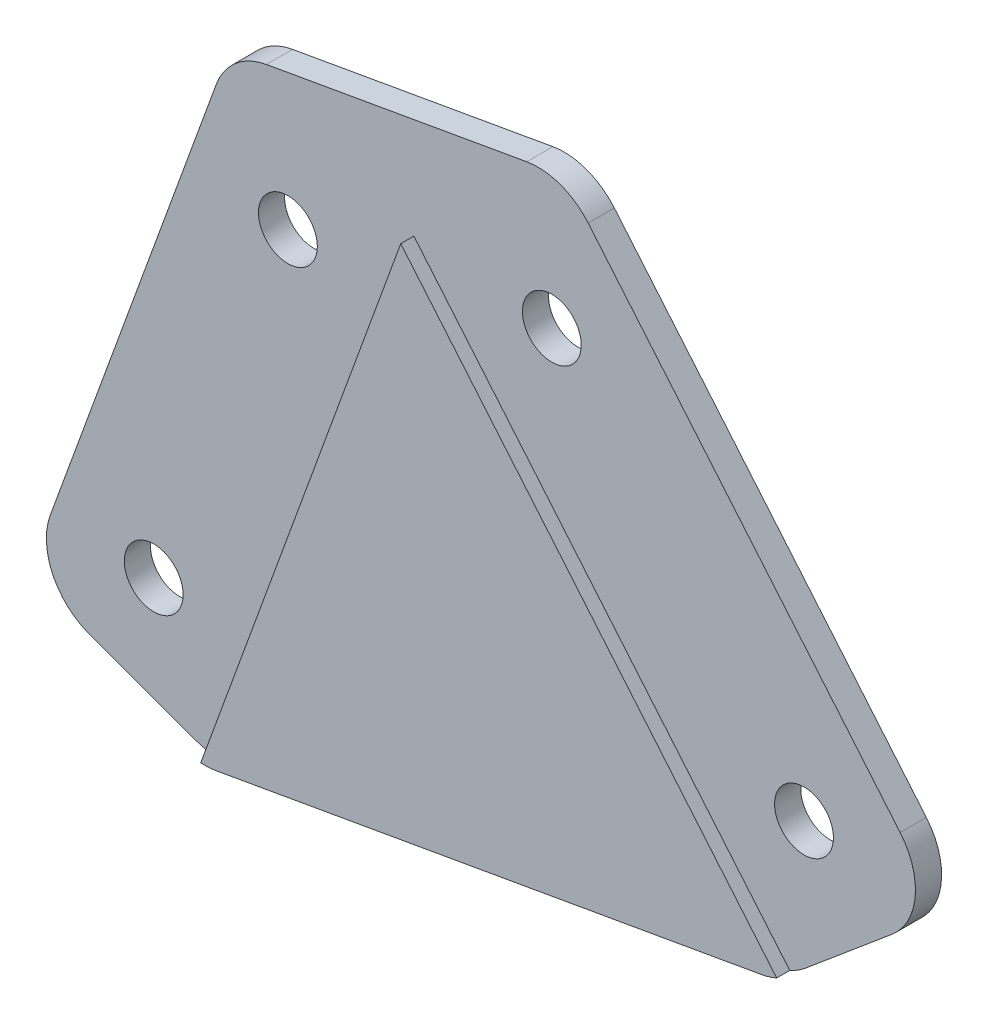
ISO-10303-21;
HEADER;
FILE_DESCRIPTION(('STEP AP214'),'2;1');
FILE_NAME('part.step','',(''),(''),'','','');
FILE_SCHEMA(('AUTOMOTIVE_DESIGN { 1 0 10303 214 1 1 1 1 }'));
ENDSEC;
DATA;
#1=APPLICATION_CONTEXT('core data for automotive mechanical design processes');
#2=APPLICATION_PROTOCOL_DEFINITION('international standard','automotive_design',2000,#1);
#3=PRODUCT_CONTEXT('',#1,'mechanical');
#4=PRODUCT('Part','Part','',(#3));
#5=PRODUCT_RELATED_PRODUCT_CATEGORY('part','',(#4));
#6=PRODUCT_DEFINITION_FORMATION('','',#4);
#7=PRODUCT_DEFINITION_CONTEXT('part definition',#1,'design');
#8=PRODUCT_DEFINITION('design','',#6,#7);
#9=PRODUCT_DEFINITION_SHAPE('','',#8);
#10=(LENGTH_UNIT() NAMED_UNIT(*) SI_UNIT(.MILLI.,.METRE.));
#11=(NAMED_UNIT(*) PLANE_ANGLE_UNIT() SI_UNIT($,.RADIAN.));
#12=(NAMED_UNIT(*) SI_UNIT($,.STERADIAN.) SOLID_ANGLE_UNIT());
#13=UNCERTAINTY_MEASURE_WITH_UNIT(LENGTH_MEASURE(1.E-05),#10,'distance_accuracy_value','');
#14=(GEOMETRIC_REPRESENTATION_CONTEXT(3) GLOBAL_UNCERTAINTY_ASSIGNED_CONTEXT((#13)) GLOBAL_UNIT_ASSIGNED_CONTEXT((#10,
#11,#12)) REPRESENTATION_CONTEXT('',''));
#15=CARTESIAN_POINT('',(0.,0.,0.));
#16=DIRECTION('',(0.,0.,1.));
#17=DIRECTION('',(1.,0.,0.));
#18=AXIS2_PLACEMENT_3D('',#15,#16,#17);
#19=CARTESIAN_POINT('',(269.693265733507,226.299519807985,3.));
#20=DIRECTION('',(-0.766044443118974,-0.642787609686544,0.));
#21=DIRECTION('',(0.642787609686544,-0.766044443118974,0.));
#22=AXIS2_PLACEMENT_3D('',#19,#20,#21);
#23=PLANE('',#22);
#24=DIRECTION('',(0.,0.,-1.));
#25=VECTOR('',#24,1.);
#26=CARTESIAN_POINT('',(146.461449044572,373.161480068931,3.));
#27=LINE('',#26,#25);
#28=CARTESIAN_POINT('',(146.461449044572,373.161480068931,0.));
#29=VERTEX_POINT('',#28);
#30=CARTESIAN_POINT('',(146.461449044572,373.161480068931,2.));
#31=VERTEX_POINT('',#30);
#32=EDGE_CURVE('E255',#29,#31,#27,.F.);
#33=ORIENTED_EDGE('',*,*,#32,.T.);
#34=DIRECTION('',(-0.642787609686544,0.766044443118974,0.));
#35=VECTOR('',#34,1.);
#36=CARTESIAN_POINT('',(140.106367779345,380.735170997994,2.));
#37=LINE('',#36,#35);
#38=CARTESIAN_POINT('',(170.317385434613,344.731082171402,2.));
#39=VERTEX_POINT('',#38);
#40=EDGE_CURVE('E168',#39,#31,#37,.T.);
#41=ORIENTED_EDGE('',*,*,#40,.F.);
#42=DIRECTION('',(0.,0.,-1.));
#43=VECTOR('',#42,1.);
#44=CARTESIAN_POINT('',(170.317385434613,344.731082171402,3.));
#45=LINE('',#44,#43);
#46=CARTESIAN_POINT('',(170.317385434613,344.731082171402,0.));
#47=VERTEX_POINT('',#46);
#48=EDGE_CURVE('E253',#39,#47,#45,.T.);
#49=ORIENTED_EDGE('',*,*,#48,.T.);
#50=DIRECTION('',(-0.642787609686544,0.766044443118974,0.));
#51=VECTOR('',#50,1.);
#52=CARTESIAN_POINT('',(269.693265733507,226.299519807985,0.));
#53=LINE('',#52,#51);
#54=EDGE_CURVE('E209',#47,#29,#53,.T.);
#55=ORIENTED_EDGE('',*,*,#54,.T.);
#56=EDGE_LOOP('',(#33,#41,#49,#55));
#57=FACE_BOUND('',#56,.T.);
#58=ADVANCED_FACE('F41',(#57),#23,.F.);
#59=CARTESIAN_POINT('',(-59.8321388186766,339.324921111203,3.));
#60=DIRECTION('',(0.173648177666931,-0.984807753012208,0.));
#61=DIRECTION('',(0.984807753012208,0.173648177666931,0.));
#62=AXIS2_PLACEMENT_3D('',#59,#60,#61);
#63=PLANE('',#62);
#64=DIRECTION('',(0.,0.,-1.));
#65=VECTOR('',#64,1.);
#66=CARTESIAN_POINT('',(121.862720195086,371.36262701135,3.));
#67=LINE('',#66,#65);
#68=CARTESIAN_POINT('',(121.862720195086,371.36262701135,0.));
#69=VERTEX_POINT('',#68);
#70=CARTESIAN_POINT('',(121.862720195086,371.36262701135,2.));
#71=VERTEX_POINT('',#70);
#72=EDGE_CURVE('E220',#69,#71,#67,.F.);
#73=ORIENTED_EDGE('',*,*,#72,.T.);
#74=DIRECTION('',(0.984807753012208,0.173648177666931,0.));
#75=VECTOR('',#74,1.);
#76=CARTESIAN_POINT('',(-59.8321388186766,339.324921111203,2.));
#77=LINE('',#76,#75);
#78=CARTESIAN_POINT('',(141.762985940643,374.87158078556,2.));
#79=VERTEX_POINT('',#78);
#80=EDGE_CURVE('E188',#71,#79,#77,.T.);
#81=ORIENTED_EDGE('',*,*,#80,.T.);
#82=DIRECTION('',(0.,0.,-1.));
#83=VECTOR('',#82,1.);
#84=CARTESIAN_POINT('',(141.762985940643,374.87158078556,3.));
#85=LINE('',#84,#83);
#86=CARTESIAN_POINT('',(141.762985940643,374.87158078556,0.));
#87=VERTEX_POINT('',#86);
#88=EDGE_CURVE('E239',#79,#87,#85,.T.);
#89=ORIENTED_EDGE('',*,*,#88,.T.);
#90=DIRECTION('',(-0.984807753012208,-0.173648177666931,0.));
#91=VECTOR('',#90,1.);
#92=CARTESIAN_POINT('',(-59.8321388186766,339.324921111203,0.));
#93=LINE('',#92,#91);
#94=EDGE_CURVE('E224',#87,#69,#93,.T.);
#95=ORIENTED_EDGE('',*,*,#94,.T.);
#96=EDGE_LOOP('',(#73,#81,#89,#95));
#97=FACE_BOUND('',#96,.T.);
#98=ADVANCED_FACE('F322',(#97),#63,.F.);
#99=CARTESIAN_POINT('',(-14.0953893117889,5.1303021498852,3.));
#100=DIRECTION('',(0.939692620785907,-0.342020143325673,0.));
#101=DIRECTION('',(0.342020143325673,0.939692620785907,0.));
#102=AXIS2_PLACEMENT_3D('',#99,#100,#101);
#103=PLANE('',#102);
#104=DIRECTION('',(0.,0.,-1.));
#105=VECTOR('',#104,1.);
#106=CARTESIAN_POINT('',(105.339019355551,333.273643069312,3.));
#107=LINE('',#106,#105);
#108=CARTESIAN_POINT('',(105.339019355551,333.273643069312,0.));
#109=VERTEX_POINT('',#108);
#110=CARTESIAN_POINT('',(105.339019355551,333.273643069312,2.));
#111=VERTEX_POINT('',#110);
#112=EDGE_CURVE('E263',#109,#111,#107,.F.);
#113=ORIENTED_EDGE('',*,*,#112,.T.);
#114=DIRECTION('',(-0.342020143325673,-0.939692620785907,0.));
#115=VECTOR('',#114,1.);
#116=CARTESIAN_POINT('',(121.413966091857,377.439196246249,2.));
#117=LINE('',#116,#115);
#118=CARTESIAN_POINT('',(118.032497979491,368.148688962917,2.));
#119=VERTEX_POINT('',#118);
#120=EDGE_CURVE('E56',#119,#111,#117,.T.);
#121=ORIENTED_EDGE('',*,*,#120,.F.);
#122=DIRECTION('',(0.,0.,-1.));
#123=VECTOR('',#122,1.);
#124=CARTESIAN_POINT('',(118.032497979491,368.148688962917,3.));
#125=LINE('',#124,#123);
#126=CARTESIAN_POINT('',(118.032497979491,368.148688962917,0.));
#127=VERTEX_POINT('',#126);
#128=EDGE_CURVE('E266',#119,#127,#125,.T.);
#129=ORIENTED_EDGE('',*,*,#128,.T.);
#130=DIRECTION('',(-0.342020143325673,-0.939692620785907,0.));
#131=VECTOR('',#130,1.);
#132=CARTESIAN_POINT('',(-14.0953893117889,5.1303021498852,0.));
#133=LINE('',#132,#131);
#134=EDGE_CURVE('E227',#127,#109,#133,.T.);
#135=ORIENTED_EDGE('',*,*,#134,.T.);
#136=EDGE_LOOP('',(#113,#121,#129,#135));
#137=FACE_BOUND('',#136,.T.);
#138=ADVANCED_FACE('F330',(#137),#103,.F.);
#139=CARTESIAN_POINT('',(117.724307950711,323.444877815497,3.));
#140=DIRECTION('',(0.342020143325671,0.939692620785907,0.));
#141=DIRECTION('',(-0.939692620785908,0.342020143325671,0.));
#142=AXIS2_PLACEMENT_3D('',#139,#140,#141);
#143=PLANE('',#142);
#144=DIRECTION('',(0.,0.,-1.));
#145=VECTOR('',#144,1.);
#146=CARTESIAN_POINT('',(116.465358556346,323.903097921494,3.));
#147=LINE('',#146,#145);
#148=CARTESIAN_POINT('',(116.465358556346,323.903097921494,0.));
#149=VERTEX_POINT('',#148);
#150=CARTESIAN_POINT('',(116.465358556346,323.903097921494,2.));
#151=VERTEX_POINT('',#150);
#152=EDGE_CURVE('E279',#149,#151,#147,.F.);
#153=ORIENTED_EDGE('',*,*,#152,.T.);
#154=DIRECTION('',(0.939692620785907,-0.342020143325672,0.));
#155=VECTOR('',#154,1.);
#156=CARTESIAN_POINT('',(103.628918638922,328.575179965382,2.));
#157=LINE('',#156,#155);
#158=CARTESIAN_POINT('',(108.327381742852,326.865079248754,2.));
#159=VERTEX_POINT('',#158);
#160=EDGE_CURVE('E159',#159,#151,#157,.T.);
#161=ORIENTED_EDGE('',*,*,#160,.F.);
#162=DIRECTION('',(0.,0.,-1.));
#163=VECTOR('',#162,1.);
#164=CARTESIAN_POINT('',(108.327381742852,326.865079248754,3.));
#165=LINE('',#164,#163);
#166=CARTESIAN_POINT('',(108.327381742852,326.865079248754,0.));
#167=VERTEX_POINT('',#166);
#168=EDGE_CURVE('E277',#159,#167,#165,.T.);
#169=ORIENTED_EDGE('',*,*,#168,.T.);
#170=DIRECTION('',(0.939692620785907,-0.342020143325671,0.));
#171=VECTOR('',#170,1.);
#172=CARTESIAN_POINT('',(117.724307950711,323.444877815497,0.));
#173=LINE('',#172,#171);
#174=EDGE_CURVE('E230',#167,#149,#173,.T.);
#175=ORIENTED_EDGE('',*,*,#174,.T.);
#176=EDGE_LOOP('',(#153,#161,#169,#175));
#177=FACE_BOUND('',#176,.T.);
#178=ADVANCED_FACE('F336',(#177),#143,.F.);
#179=CARTESIAN_POINT('',(-51.7625094930553,293.559779025751,3.));
#180=DIRECTION('',(-0.173648177666932,0.984807753012208,0.));
#181=DIRECTION('',(-0.984807753012208,-0.173648177666932,0.));
#182=AXIS2_PLACEMENT_3D('',#179,#180,#181);
#183=PLANE('',#182);
#184=DIRECTION('',(0.984807753012208,0.173648177666932,0.));
#185=VECTOR('',#184,1.);
#186=CARTESIAN_POINT('',(-51.7625094930553,293.559779025751,0.));
#187=LINE('',#186,#185);
#188=CARTESIAN_POINT('',(119.043700161309,323.677522260362,0.));
#189=VERTEX_POINT('',#188);
#190=CARTESIAN_POINT('',(160.721264625663,331.026401365644,0.));
#191=VERTEX_POINT('',#190);
#192=EDGE_CURVE('E233',#189,#191,#187,.T.);
#193=ORIENTED_EDGE('',*,*,#192,.T.);
#194=DIRECTION('',(0.,0.,-1.));
#195=VECTOR('',#194,1.);
#196=CARTESIAN_POINT('',(160.721264625663,331.026401365644,3.));
#197=LINE('',#196,#195);
#198=CARTESIAN_POINT('',(160.721264625663,331.026401365644,3.));
#199=VERTEX_POINT('',#198);
#200=EDGE_CURVE('E64',#191,#199,#197,.F.);
#201=ORIENTED_EDGE('',*,*,#200,.T.);
#202=DIRECTION('',(0.984807753012208,0.173648177666932,0.));
#203=VECTOR('',#202,1.);
#204=CARTESIAN_POINT('',(-51.7625094930553,293.559779025751,3.));
#205=LINE('',#204,#203);
#206=CARTESIAN_POINT('',(119.043700161309,323.677522260362,3.));
#207=VERTEX_POINT('',#206);
#208=EDGE_CURVE('E218',#207,#199,#205,.T.);
#209=ORIENTED_EDGE('',*,*,#208,.F.);
#210=DIRECTION('',(0.,0.,-1.));
#211=VECTOR('',#210,1.);
#212=CARTESIAN_POINT('',(119.043700161309,323.677522260362,3.));
#213=LINE('',#212,#211);
#214=EDGE_CURVE('E273',#207,#189,#213,.T.);
#215=ORIENTED_EDGE('',*,*,#214,.T.);
#216=EDGE_LOOP('',(#193,#201,#209,#215));
#217=FACE_BOUND('',#216,.T.);
#218=ADVANCED_FACE('F291',(#217),#183,.F.);
#219=CARTESIAN_POINT('',(-96.1619422504616,114.601340147824,3.));
#220=DIRECTION('',(-0.642787609686542,0.766044443118976,0.));
#221=DIRECTION('',(-0.766044443118976,-0.642787609686542,0.));
#222=AXIS2_PLACEMENT_3D('',#219,#220,#221);
#223=PLANE('',#222);
#224=DIRECTION('',(0.,0.,-1.));
#225=VECTOR('',#224,1.);
#226=CARTESIAN_POINT('',(169.701101267451,337.686921907375,3.));
#227=LINE('',#226,#225);
#228=CARTESIAN_POINT('',(169.701101267451,337.686921907375,0.));
#229=VERTEX_POINT('',#228);
#230=CARTESIAN_POINT('',(169.701101267451,337.686921907375,2.));
#231=VERTEX_POINT('',#230);
#232=EDGE_CURVE('E270',#229,#231,#227,.F.);
#233=ORIENTED_EDGE('',*,*,#232,.T.);
#234=DIRECTION('',(0.766044443118974,0.642787609686544,0.));
#235=VECTOR('',#234,1.);
#236=CARTESIAN_POINT('',(173.531323483045,340.900859955807,2.));
#237=LINE('',#236,#235);
#238=CARTESIAN_POINT('',(163.066961785761,332.120217915111,2.));
#239=VERTEX_POINT('',#238);
#240=EDGE_CURVE('E172',#239,#231,#237,.T.);
#241=ORIENTED_EDGE('',*,*,#240,.F.);
#242=DIRECTION('',(0.,0.,-1.));
#243=VECTOR('',#242,1.);
#244=CARTESIAN_POINT('',(163.066961785761,332.120217915111,3.));
#245=LINE('',#244,#243);
#246=CARTESIAN_POINT('',(163.066961785761,332.120217915111,0.));
#247=VERTEX_POINT('',#246);
#248=EDGE_CURVE('E268',#239,#247,#245,.T.);
#249=ORIENTED_EDGE('',*,*,#248,.T.);
#250=DIRECTION('',(0.766044443118976,0.642787609686542,0.));
#251=VECTOR('',#250,1.);
#252=CARTESIAN_POINT('',(-96.1619422504616,114.601340147824,0.));
#253=LINE('',#252,#251);
#254=EDGE_CURVE('E221',#247,#229,#253,.T.);
#255=ORIENTED_EDGE('',*,*,#254,.T.);
#256=EDGE_LOOP('',(#233,#241,#249,#255));
#257=FACE_BOUND('',#256,.T.);
#258=ADVANCED_FACE('F305',(#257),#223,.F.);
#259=CARTESIAN_POINT('',(0.,0.,3.));
#260=DIRECTION('',(0.,0.,1.));
#261=DIRECTION('',(1.,0.,0.));
#262=AXIS2_PLACEMENT_3D('',#259,#260,#261);
#263=PLANE('',#262);
#264=DIRECTION('',(0.642787609686543,-0.766044443118975,0.));
#265=VECTOR('',#264,1.);
#266=CARTESIAN_POINT('',(133.132579218133,365.632564975562,3.));
#267=LINE('',#266,#265);
#268=CARTESIAN_POINT('',(133.132579218133,365.632564975562,3.));
#269=VERTEX_POINT('',#268);
#270=CARTESIAN_POINT('',(161.875711881928,331.377833361072,3.));
#271=VERTEX_POINT('',#270);
#272=EDGE_CURVE('E179',#269,#271,#267,.T.);
#273=ORIENTED_EDGE('',*,*,#272,.F.);
#274=DIRECTION('',(0.342020143325671,0.939692620785907,0.));
#275=VECTOR('',#274,1.);
#276=CARTESIAN_POINT('',(133.132579218133,365.632564975562,3.));
#277=LINE('',#276,#275);
#278=CARTESIAN_POINT('',(117.838677772064,323.612916097124,3.));
#279=VERTEX_POINT('',#278);
#280=EDGE_CURVE('E165',#279,#269,#277,.T.);
#281=ORIENTED_EDGE('',*,*,#280,.F.);
#282=CARTESIAN_POINT('',(118.175459272974,328.601561025423,3.));
#283=DIRECTION('',(0.,0.,1.));
#284=DIRECTION('',(1.,0.,0.));
#285=AXIS2_PLACEMENT_3D('',#282,#283,#284);
#286=CIRCLE('',#285,5.);
#287=EDGE_CURVE('E258',#279,#207,#286,.T.);
#288=ORIENTED_EDGE('',*,*,#287,.T.);
#289=ORIENTED_EDGE('',*,*,#208,.T.);
#290=CARTESIAN_POINT('',(159.853023737329,335.950440130705,3.));
#291=DIRECTION('',(0.,0.,1.));
#292=DIRECTION('',(1.,0.,0.));
#293=AXIS2_PLACEMENT_3D('',#290,#291,#292);
#294=CIRCLE('',#293,5.);
#295=EDGE_CURVE('E260',#199,#271,#294,.T.);
#296=ORIENTED_EDGE('',*,*,#295,.T.);
#297=EDGE_LOOP('',(#273,#281,#288,#289,#296));
#298=FACE_BOUND('',#297,.T.);
#299=ADVANCED_FACE('F286',(#298),#263,.T.);
#300=CARTESIAN_POINT('',(0.,0.,0.));
#301=DIRECTION('',(0.,0.,1.));
#302=DIRECTION('',(1.,0.,0.));
#303=AXIS2_PLACEMENT_3D('',#300,#301,#302);
#304=PLANE('',#303);
#305=CARTESIAN_POINT('',(113.241764369759,333.057723546334,0.));
#306=DIRECTION('',(0.,0.,1.));
#307=DIRECTION('',(1.,0.,0.));
#308=AXIS2_PLACEMENT_3D('',#305,#306,#307);
#309=CIRCLE('',#308,2.25);
#310=CARTESIAN_POINT('',(115.491764369759,333.057723546334,0.));
#311=VERTEX_POINT('',#310);
#312=EDGE_CURVE('E206',#311,#311,#309,.T.);
#313=ORIENTED_EDGE('',*,*,#312,.T.);
#314=EDGE_LOOP('',(#313));
#315=FACE_BOUND('',#314,.T.);
#316=CARTESIAN_POINT('',(123.50236866953,361.248502169911,0.));
#317=DIRECTION('',(0.,0.,1.));
#318=DIRECTION('',(1.,0.,0.));
#319=AXIS2_PLACEMENT_3D('',#316,#317,#318);
#320=CIRCLE('',#319,2.25000000000001);
#321=CARTESIAN_POINT('',(125.75236866953,361.248502169911,0.));
#322=VERTEX_POINT('',#321);
#323=EDGE_CURVE('E210',#322,#322,#320,.T.);
#324=ORIENTED_EDGE('',*,*,#323,.T.);
#325=EDGE_LOOP('',(#324));
#326=FACE_BOUND('',#325,.T.);
#327=CARTESIAN_POINT('',(143.681454796408,364.80661950012,0.));
#328=DIRECTION('',(0.,0.,1.));
#329=DIRECTION('',(1.,0.,0.));
#330=AXIS2_PLACEMENT_3D('',#327,#328,#329);
#331=CIRCLE('',#330,2.25000000000001);
#332=CARTESIAN_POINT('',(145.931454796408,364.80661950012,0.));
#333=VERTEX_POINT('',#332);
#334=EDGE_CURVE('E213',#333,#333,#331,.T.);
#335=ORIENTED_EDGE('',*,*,#334,.T.);
#336=EDGE_LOOP('',(#335));
#337=FACE_BOUND('',#336,.T.);
#338=CARTESIAN_POINT('',(162.965083087004,341.825286206551,0.));
#339=DIRECTION('',(0.,0.,1.));
#340=DIRECTION('',(1.,0.,0.));
#341=AXIS2_PLACEMENT_3D('',#338,#339,#340);
#342=CIRCLE('',#341,2.25000000000001);
#343=CARTESIAN_POINT('',(165.215083087004,341.825286206551,0.));
#344=VERTEX_POINT('',#343);
#345=EDGE_CURVE('E205',#344,#344,#342,.T.);
#346=ORIENTED_EDGE('',*,*,#345,.T.);
#347=EDGE_LOOP('',(#346));
#348=FACE_BOUND('',#347,.T.);
#349=ORIENTED_EDGE('',*,*,#94,.F.);
#350=CARTESIAN_POINT('',(142.631226828978,369.947542020499,0.));
#351=DIRECTION('',(0.,0.,1.));
#352=DIRECTION('',(1.,0.,0.));
#353=AXIS2_PLACEMENT_3D('',#350,#351,#352);
#354=CIRCLE('',#353,5.);
#355=EDGE_CURVE('E251',#87,#29,#354,.F.);
#356=ORIENTED_EDGE('',*,*,#355,.T.);
#357=ORIENTED_EDGE('',*,*,#54,.F.);
#358=CARTESIAN_POINT('',(166.487163219018,341.51714412297,0.));
#359=DIRECTION('',(0.,0.,1.));
#360=DIRECTION('',(1.,0.,0.));
#361=AXIS2_PLACEMENT_3D('',#358,#359,#360);
#362=CIRCLE('',#361,5.);
#363=EDGE_CURVE('E247',#47,#229,#362,.F.);
#364=ORIENTED_EDGE('',*,*,#363,.T.);
#365=ORIENTED_EDGE('',*,*,#254,.F.);
#366=CARTESIAN_POINT('',(159.853023737329,335.950440130705,0.));
#367=DIRECTION('',(0.,0.,1.));
#368=DIRECTION('',(1.,0.,0.));
#369=AXIS2_PLACEMENT_3D('',#366,#367,#368);
#370=CIRCLE('',#369,5.);
#371=EDGE_CURVE('E245',#247,#191,#370,.F.);
#372=ORIENTED_EDGE('',*,*,#371,.T.);
#373=ORIENTED_EDGE('',*,*,#192,.F.);
#374=CARTESIAN_POINT('',(118.175459272974,328.601561025423,0.));
#375=DIRECTION('',(0.,0.,1.));
#376=DIRECTION('',(1.,0.,0.));
#377=AXIS2_PLACEMENT_3D('',#374,#375,#376);
#378=CIRCLE('',#377,5.);
#379=EDGE_CURVE('E243',#189,#149,#378,.F.);
#380=ORIENTED_EDGE('',*,*,#379,.T.);
#381=ORIENTED_EDGE('',*,*,#174,.F.);
#382=CARTESIAN_POINT('',(110.03748245948,331.563542352683,0.));
#383=DIRECTION('',(0.,0.,1.));
#384=DIRECTION('',(1.,0.,0.));
#385=AXIS2_PLACEMENT_3D('',#382,#383,#384);
#386=CIRCLE('',#385,5.);
#387=EDGE_CURVE('E241',#167,#109,#386,.F.);
#388=ORIENTED_EDGE('',*,*,#387,.T.);
#389=ORIENTED_EDGE('',*,*,#134,.F.);
#390=CARTESIAN_POINT('',(122.730961083421,366.438588246289,0.));
#391=DIRECTION('',(0.,0.,1.));
#392=DIRECTION('',(1.,0.,0.));
#393=AXIS2_PLACEMENT_3D('',#390,#391,#392);
#394=CIRCLE('',#393,5.);
#395=EDGE_CURVE('E249',#127,#69,#394,.F.);
#396=ORIENTED_EDGE('',*,*,#395,.T.);
#397=EDGE_LOOP('',(#349,#356,#357,#364,#365,#372,#373,#380,#381,#388,#389,#396));
#398=FACE_BOUND('',#397,.T.);
#399=ADVANCED_FACE('F294',(#315,#326,#337,#348,#398),#304,.F.);
#400=CARTESIAN_POINT('',(162.965083087004,341.825286206551,0.));
#401=DIRECTION('',(0.,0.,1.));
#402=DIRECTION('',(1.,0.,0.));
#403=AXIS2_PLACEMENT_3D('',#400,#401,#402);
#404=CYLINDRICAL_SURFACE('',#403,2.25000000000001);
#405=CARTESIAN_POINT('',(162.965083087004,341.825286206551,2.));
#406=DIRECTION('',(0.,0.,-1.));
#407=DIRECTION('',(-1.,0.,0.));
#408=AXIS2_PLACEMENT_3D('',#405,#406,#407);
#409=CIRCLE('',#408,2.25000000000001);
#410=CARTESIAN_POINT('',(160.715083087004,341.825286206551,2.));
#411=VERTEX_POINT('',#410);
#412=EDGE_CURVE('E202',#411,#411,#409,.F.);
#413=ORIENTED_EDGE('',*,*,#412,.T.);
#414=EDGE_LOOP('',(#413));
#415=FACE_BOUND('',#414,.T.);
#416=ORIENTED_EDGE('',*,*,#345,.F.);
#417=EDGE_LOOP('',(#416));
#418=FACE_BOUND('',#417,.T.);
#419=ADVANCED_FACE('F413',(#415,#418),#404,.F.);
#420=CARTESIAN_POINT('',(143.681454796408,364.80661950012,0.));
#421=DIRECTION('',(0.,0.,1.));
#422=DIRECTION('',(1.,0.,0.));
#423=AXIS2_PLACEMENT_3D('',#420,#421,#422);
#424=CYLINDRICAL_SURFACE('',#423,2.25000000000001);
#425=CARTESIAN_POINT('',(143.681454796408,364.80661950012,2.));
#426=DIRECTION('',(0.,0.,-1.));
#427=DIRECTION('',(-1.,0.,0.));
#428=AXIS2_PLACEMENT_3D('',#425,#426,#427);
#429=CIRCLE('',#428,2.25000000000001);
#430=CARTESIAN_POINT('',(141.431454796408,364.80661950012,2.));
#431=VERTEX_POINT('',#430);
#432=EDGE_CURVE('E199',#431,#431,#429,.F.);
#433=ORIENTED_EDGE('',*,*,#432,.T.);
#434=EDGE_LOOP('',(#433));
#435=FACE_BOUND('',#434,.T.);
#436=ORIENTED_EDGE('',*,*,#334,.F.);
#437=EDGE_LOOP('',(#436));
#438=FACE_BOUND('',#437,.T.);
#439=ADVANCED_FACE('F409',(#435,#438),#424,.F.);
#440=CARTESIAN_POINT('',(123.50236866953,361.248502169911,0.));
#441=DIRECTION('',(0.,0.,1.));
#442=DIRECTION('',(1.,0.,0.));
#443=AXIS2_PLACEMENT_3D('',#440,#441,#442);
#444=CYLINDRICAL_SURFACE('',#443,2.25000000000001);
#445=CARTESIAN_POINT('',(123.50236866953,361.248502169911,2.));
#446=DIRECTION('',(0.,0.,-1.));
#447=DIRECTION('',(-1.,0.,0.));
#448=AXIS2_PLACEMENT_3D('',#445,#446,#447);
#449=CIRCLE('',#448,2.25000000000001);
#450=CARTESIAN_POINT('',(121.25236866953,361.248502169911,2.));
#451=VERTEX_POINT('',#450);
#452=EDGE_CURVE('E196',#451,#451,#449,.F.);
#453=ORIENTED_EDGE('',*,*,#452,.T.);
#454=EDGE_LOOP('',(#453));
#455=FACE_BOUND('',#454,.T.);
#456=ORIENTED_EDGE('',*,*,#323,.F.);
#457=EDGE_LOOP('',(#456));
#458=FACE_BOUND('',#457,.T.);
#459=ADVANCED_FACE('F405',(#455,#458),#444,.F.);
#460=CARTESIAN_POINT('',(113.241764369759,333.057723546334,0.));
#461=DIRECTION('',(0.,0.,1.));
#462=DIRECTION('',(1.,0.,0.));
#463=AXIS2_PLACEMENT_3D('',#460,#461,#462);
#464=CYLINDRICAL_SURFACE('',#463,2.25);
#465=CARTESIAN_POINT('',(113.241764369759,333.057723546334,2.));
#466=DIRECTION('',(0.,0.,-1.));
#467=DIRECTION('',(-1.,0.,0.));
#468=AXIS2_PLACEMENT_3D('',#465,#466,#467);
#469=CIRCLE('',#468,2.25);
#470=CARTESIAN_POINT('',(110.991764369759,333.057723546334,2.));
#471=VERTEX_POINT('',#470);
#472=EDGE_CURVE('E193',#471,#471,#469,.F.);
#473=ORIENTED_EDGE('',*,*,#472,.T.);
#474=EDGE_LOOP('',(#473));
#475=FACE_BOUND('',#474,.T.);
#476=ORIENTED_EDGE('',*,*,#312,.F.);
#477=EDGE_LOOP('',(#476));
#478=FACE_BOUND('',#477,.T.);
#479=ADVANCED_FACE('F357',(#475,#478),#464,.F.);
#480=CARTESIAN_POINT('',(142.631226828978,369.947542020499,3.));
#481=DIRECTION('',(0.,0.,-1.));
#482=DIRECTION('',(-1.,0.,0.));
#483=AXIS2_PLACEMENT_3D('',#480,#481,#482);
#484=CYLINDRICAL_SURFACE('',#483,5.);
#485=CARTESIAN_POINT('',(142.631226828978,369.947542020499,2.));
#486=DIRECTION('',(0.,0.,-1.));
#487=DIRECTION('',(-1.,0.,0.));
#488=AXIS2_PLACEMENT_3D('',#485,#486,#487);
#489=CIRCLE('',#488,5.);
#490=EDGE_CURVE('E191',#31,#79,#489,.F.);
#491=ORIENTED_EDGE('',*,*,#490,.F.);
#492=ORIENTED_EDGE('',*,*,#32,.F.);
#493=ORIENTED_EDGE('',*,*,#355,.F.);
#494=ORIENTED_EDGE('',*,*,#88,.F.);
#495=EDGE_LOOP('',(#491,#492,#493,#494));
#496=FACE_BOUND('',#495,.T.);
#497=ADVANCED_FACE('F318',(#496),#484,.T.);
#498=CARTESIAN_POINT('',(122.730961083421,366.438588246289,3.));
#499=DIRECTION('',(0.,0.,-1.));
#500=DIRECTION('',(-1.,0.,0.));
#501=AXIS2_PLACEMENT_3D('',#498,#499,#500);
#502=CYLINDRICAL_SURFACE('',#501,5.);
#503=CARTESIAN_POINT('',(122.730961083421,366.438588246289,2.));
#504=DIRECTION('',(0.,0.,-1.));
#505=DIRECTION('',(-1.,0.,0.));
#506=AXIS2_PLACEMENT_3D('',#503,#504,#505);
#507=CIRCLE('',#506,5.);
#508=EDGE_CURVE('E186',#71,#119,#507,.F.);
#509=ORIENTED_EDGE('',*,*,#508,.F.);
#510=ORIENTED_EDGE('',*,*,#72,.F.);
#511=ORIENTED_EDGE('',*,*,#395,.F.);
#512=ORIENTED_EDGE('',*,*,#128,.F.);
#513=EDGE_LOOP('',(#509,#510,#511,#512));
#514=FACE_BOUND('',#513,.T.);
#515=ADVANCED_FACE('F326',(#514),#502,.T.);
#516=CARTESIAN_POINT('',(166.487163219018,341.51714412297,3.));
#517=DIRECTION('',(0.,0.,-1.));
#518=DIRECTION('',(-1.,0.,0.));
#519=AXIS2_PLACEMENT_3D('',#516,#517,#518);
#520=CYLINDRICAL_SURFACE('',#519,5.);
#521=CARTESIAN_POINT('',(166.487163219018,341.51714412297,2.));
#522=DIRECTION('',(0.,0.,-1.));
#523=DIRECTION('',(-1.,0.,0.));
#524=AXIS2_PLACEMENT_3D('',#521,#522,#523);
#525=CIRCLE('',#524,5.);
#526=EDGE_CURVE('E184',#231,#39,#525,.F.);
#527=ORIENTED_EDGE('',*,*,#526,.F.);
#528=ORIENTED_EDGE('',*,*,#232,.F.);
#529=ORIENTED_EDGE('',*,*,#363,.F.);
#530=ORIENTED_EDGE('',*,*,#48,.F.);
#531=EDGE_LOOP('',(#527,#528,#529,#530));
#532=FACE_BOUND('',#531,.T.);
#533=ADVANCED_FACE('F309',(#532),#520,.T.);
#534=CARTESIAN_POINT('',(159.853023737329,335.950440130705,3.));
#535=DIRECTION('',(0.,0.,-1.));
#536=DIRECTION('',(-1.,0.,0.));
#537=AXIS2_PLACEMENT_3D('',#534,#535,#536);
#538=CYLINDRICAL_SURFACE('',#537,5.);
#539=DIRECTION('',(0.,0.,-1.));
#540=VECTOR('',#539,1.);
#541=CARTESIAN_POINT('',(161.875711881928,331.377833361072,3.));
#542=LINE('',#541,#540);
#543=CARTESIAN_POINT('',(161.875711881928,331.377833361072,2.));
#544=VERTEX_POINT('',#543);
#545=EDGE_CURVE('E11',#271,#544,#542,.T.);
#546=ORIENTED_EDGE('',*,*,#545,.F.);
#547=ORIENTED_EDGE('',*,*,#295,.F.);
#548=ORIENTED_EDGE('',*,*,#200,.F.);
#549=ORIENTED_EDGE('',*,*,#371,.F.);
#550=ORIENTED_EDGE('',*,*,#248,.F.);
#551=CARTESIAN_POINT('',(159.853023737329,335.950440130705,2.));
#552=DIRECTION('',(0.,0.,-1.));
#553=DIRECTION('',(-1.,0.,0.));
#554=AXIS2_PLACEMENT_3D('',#551,#552,#553);
#555=CIRCLE('',#554,5.);
#556=EDGE_CURVE('E182',#544,#239,#555,.F.);
#557=ORIENTED_EDGE('',*,*,#556,.F.);
#558=EDGE_LOOP('',(#546,#547,#548,#549,#550,#557));
#559=FACE_BOUND('',#558,.T.);
#560=ADVANCED_FACE('F300',(#559),#538,.T.);
#561=CARTESIAN_POINT('',(118.175459272974,328.601561025423,3.));
#562=DIRECTION('',(0.,0.,-1.));
#563=DIRECTION('',(-1.,0.,0.));
#564=AXIS2_PLACEMENT_3D('',#561,#562,#563);
#565=CYLINDRICAL_SURFACE('',#564,5.);
#566=DIRECTION('',(0.,0.,-1.));
#567=VECTOR('',#566,1.);
#568=CARTESIAN_POINT('',(117.838677772064,323.612916097124,3.));
#569=LINE('',#568,#567);
#570=CARTESIAN_POINT('',(117.838677772064,323.612916097124,2.));
#571=VERTEX_POINT('',#570);
#572=EDGE_CURVE('E49',#571,#279,#569,.F.);
#573=ORIENTED_EDGE('',*,*,#572,.F.);
#574=CARTESIAN_POINT('',(118.175459272974,328.601561025423,2.));
#575=DIRECTION('',(0.,0.,-1.));
#576=DIRECTION('',(-1.,0.,0.));
#577=AXIS2_PLACEMENT_3D('',#574,#575,#576);
#578=CIRCLE('',#577,5.);
#579=EDGE_CURVE('E156',#151,#571,#578,.F.);
#580=ORIENTED_EDGE('',*,*,#579,.F.);
#581=ORIENTED_EDGE('',*,*,#152,.F.);
#582=ORIENTED_EDGE('',*,*,#379,.F.);
#583=ORIENTED_EDGE('',*,*,#214,.F.);
#584=ORIENTED_EDGE('',*,*,#287,.F.);
#585=EDGE_LOOP('',(#573,#580,#581,#582,#583,#584));
#586=FACE_BOUND('',#585,.T.);
#587=ADVANCED_FACE('F288',(#586),#565,.T.);
#588=CARTESIAN_POINT('',(110.03748245948,331.563542352683,3.));
#589=DIRECTION('',(0.,0.,-1.));
#590=DIRECTION('',(-1.,0.,0.));
#591=AXIS2_PLACEMENT_3D('',#588,#589,#590);
#592=CYLINDRICAL_SURFACE('',#591,5.);
#593=CARTESIAN_POINT('',(110.03748245948,331.563542352683,2.));
#594=DIRECTION('',(0.,0.,-1.));
#595=DIRECTION('',(-1.,0.,0.));
#596=AXIS2_PLACEMENT_3D('',#593,#594,#595);
#597=CIRCLE('',#596,5.);
#598=EDGE_CURVE('E282',#111,#159,#597,.F.);
#599=ORIENTED_EDGE('',*,*,#598,.F.);
#600=ORIENTED_EDGE('',*,*,#112,.F.);
#601=ORIENTED_EDGE('',*,*,#387,.F.);
#602=ORIENTED_EDGE('',*,*,#168,.F.);
#603=EDGE_LOOP('',(#599,#600,#601,#602));
#604=FACE_BOUND('',#603,.T.);
#605=ADVANCED_FACE('F43',(#604),#592,.T.);
#606=CARTESIAN_POINT('',(0.,0.,2.));
#607=DIRECTION('',(0.,0.,-1.));
#608=DIRECTION('',(-1.,0.,0.));
#609=AXIS2_PLACEMENT_3D('',#606,#607,#608);
#610=PLANE('',#609);
#611=ORIENTED_EDGE('',*,*,#432,.F.);
#612=EDGE_LOOP('',(#611));
#613=FACE_BOUND('',#612,.T.);
#614=ORIENTED_EDGE('',*,*,#472,.F.);
#615=EDGE_LOOP('',(#614));
#616=FACE_BOUND('',#615,.T.);
#617=ORIENTED_EDGE('',*,*,#490,.T.);
#618=ORIENTED_EDGE('',*,*,#80,.F.);
#619=ORIENTED_EDGE('',*,*,#508,.T.);
#620=ORIENTED_EDGE('',*,*,#120,.T.);
#621=ORIENTED_EDGE('',*,*,#598,.T.);
#622=ORIENTED_EDGE('',*,*,#160,.T.);
#623=ORIENTED_EDGE('',*,*,#579,.T.);
#624=DIRECTION('',(0.342020143325671,0.939692620785907,0.));
#625=VECTOR('',#624,1.);
#626=CARTESIAN_POINT('',(133.132579218133,365.632564975562,2.));
#627=LINE('',#626,#625);
#628=CARTESIAN_POINT('',(133.132579218133,365.632564975562,2.));
#629=VERTEX_POINT('',#628);
#630=EDGE_CURVE('E148',#571,#629,#627,.T.);
#631=ORIENTED_EDGE('',*,*,#630,.T.);
#632=DIRECTION('',(0.642787609686543,-0.766044443118975,0.));
#633=VECTOR('',#632,1.);
#634=CARTESIAN_POINT('',(133.132579218133,365.632564975562,2.));
#635=LINE('',#634,#633);
#636=EDGE_CURVE('E153',#629,#544,#635,.T.);
#637=ORIENTED_EDGE('',*,*,#636,.T.);
#638=ORIENTED_EDGE('',*,*,#556,.T.);
#639=ORIENTED_EDGE('',*,*,#240,.T.);
#640=ORIENTED_EDGE('',*,*,#526,.T.);
#641=ORIENTED_EDGE('',*,*,#40,.T.);
#642=EDGE_LOOP('',(#617,#618,#619,#620,#621,#622,#623,#631,#637,#638,#639,#640,#641));
#643=FACE_BOUND('',#642,.T.);
#644=ORIENTED_EDGE('',*,*,#452,.F.);
#645=EDGE_LOOP('',(#644));
#646=FACE_BOUND('',#645,.T.);
#647=ORIENTED_EDGE('',*,*,#412,.F.);
#648=EDGE_LOOP('',(#647));
#649=FACE_BOUND('',#648,.T.);
#650=ADVANCED_FACE('F150',(#613,#616,#643,#646,#649),#610,.F.);
#651=CARTESIAN_POINT('',(133.132579218133,365.632564975562,2.));
#652=DIRECTION('',(-0.766044443118975,-0.642787609686543,0.));
#653=DIRECTION('',(0.642787609686543,-0.766044443118975,0.));
#654=AXIS2_PLACEMENT_3D('',#651,#652,#653);
#655=PLANE('',#654);
#656=ORIENTED_EDGE('',*,*,#545,.T.);
#657=ORIENTED_EDGE('',*,*,#636,.F.);
#658=DIRECTION('',(0.,0.,1.));
#659=VECTOR('',#658,1.);
#660=CARTESIAN_POINT('',(133.132579218133,365.632564975562,2.));
#661=LINE('',#660,#659);
#662=EDGE_CURVE('E162',#629,#269,#661,.T.);
#663=ORIENTED_EDGE('',*,*,#662,.T.);
#664=ORIENTED_EDGE('',*,*,#272,.T.);
#665=EDGE_LOOP('',(#656,#657,#663,#664));
#666=FACE_BOUND('',#665,.T.);
#667=ADVANCED_FACE('F170',(#666),#655,.F.);
#668=CARTESIAN_POINT('',(133.132579218133,365.632564975562,2.));
#669=DIRECTION('',(0.939692620785908,-0.342020143325671,0.));
#670=DIRECTION('',(0.342020143325671,0.939692620785908,0.));
#671=AXIS2_PLACEMENT_3D('',#668,#669,#670);
#672=PLANE('',#671);
#673=ORIENTED_EDGE('',*,*,#572,.T.);
#674=ORIENTED_EDGE('',*,*,#280,.T.);
#675=ORIENTED_EDGE('',*,*,#662,.F.);
#676=ORIENTED_EDGE('',*,*,#630,.F.);
#677=EDGE_LOOP('',(#673,#674,#675,#676));
#678=FACE_BOUND('',#677,.T.);
#679=ADVANCED_FACE('F163',(#678),#672,.F.);
#680=CLOSED_SHELL('',(#58,#98,#138,#178,#218,#258,#299,#399,#419,#439,#459,#479,#497,#515,#533,
#560,#587,#605,#650,#667,#679));
#681=MANIFOLD_SOLID_BREP('B2',#680);
#682=ADVANCED_BREP_SHAPE_REPRESENTATION('',(#18,#681),#14);
#683=SHAPE_DEFINITION_REPRESENTATION(#9,#682);
ENDSEC;
END-ISO-10303-21;
